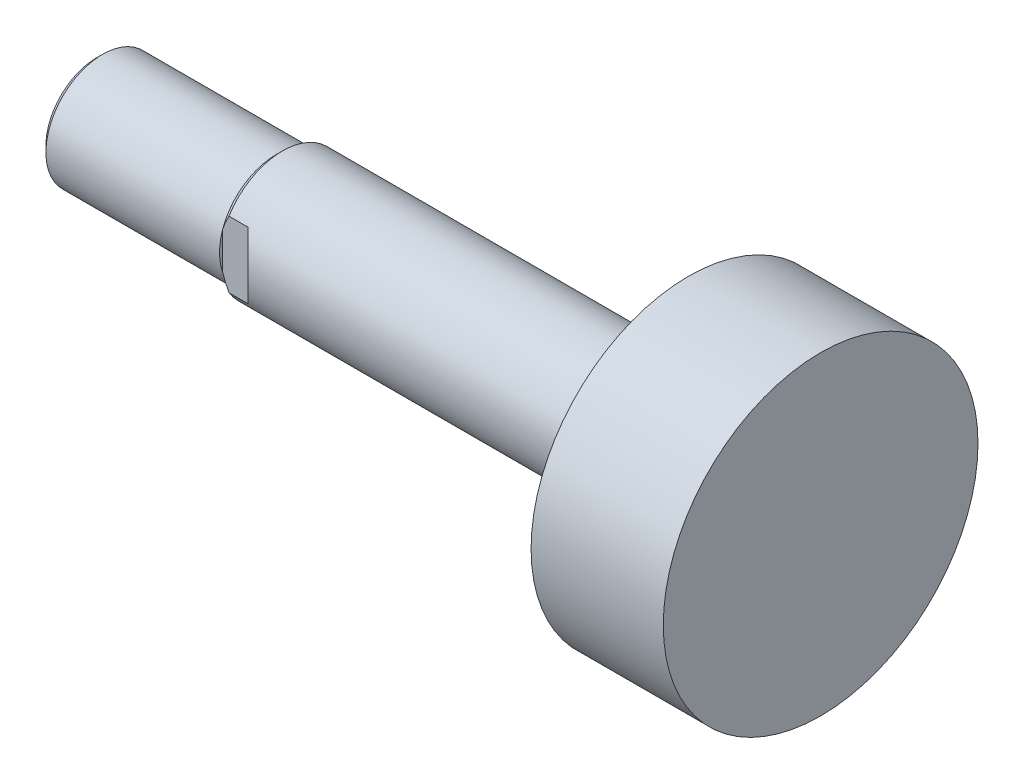
ISO-10303-21;
HEADER;
FILE_DESCRIPTION(('STEP AP214'),'2;1');
FILE_NAME('part.step','',(''),(''),'','','');
FILE_SCHEMA(('AUTOMOTIVE_DESIGN { 1 0 10303 214 1 1 1 1 }'));
ENDSEC;
DATA;
#1=APPLICATION_CONTEXT('core data for automotive mechanical design processes');
#2=APPLICATION_PROTOCOL_DEFINITION('international standard','automotive_design',2000,#1);
#3=PRODUCT_CONTEXT('',#1,'mechanical');
#4=PRODUCT('Part','Part','',(#3));
#5=PRODUCT_RELATED_PRODUCT_CATEGORY('part','',(#4));
#6=PRODUCT_DEFINITION_FORMATION('','',#4);
#7=PRODUCT_DEFINITION_CONTEXT('part definition',#1,'design');
#8=PRODUCT_DEFINITION('design','',#6,#7);
#9=PRODUCT_DEFINITION_SHAPE('','',#8);
#10=(LENGTH_UNIT() NAMED_UNIT(*) SI_UNIT(.MILLI.,.METRE.));
#11=(NAMED_UNIT(*) PLANE_ANGLE_UNIT() SI_UNIT($,.RADIAN.));
#12=(NAMED_UNIT(*) SI_UNIT($,.STERADIAN.) SOLID_ANGLE_UNIT());
#13=UNCERTAINTY_MEASURE_WITH_UNIT(LENGTH_MEASURE(1.E-05),#10,'distance_accuracy_value','');
#14=(GEOMETRIC_REPRESENTATION_CONTEXT(3) GLOBAL_UNCERTAINTY_ASSIGNED_CONTEXT((#13)) GLOBAL_UNIT_ASSIGNED_CONTEXT((#10,
#11,#12)) REPRESENTATION_CONTEXT('',''));
#15=CARTESIAN_POINT('',(0.,0.,0.));
#16=DIRECTION('',(0.,0.,1.));
#17=DIRECTION('',(1.,0.,0.));
#18=AXIS2_PLACEMENT_3D('',#15,#16,#17);
#19=CARTESIAN_POINT('',(-4.,0.,0.));
#20=DIRECTION('',(1.,0.,0.));
#21=DIRECTION('',(0.,0.,1.));
#22=AXIS2_PLACEMENT_3D('',#19,#20,#21);
#23=CONICAL_SURFACE('',#22,10.,0.785398163397448);
#24=CARTESIAN_POINT('',(-4.,0.,0.));
#25=DIRECTION('',(1.,0.,0.));
#26=DIRECTION('',(0.,0.,-1.));
#27=AXIS2_PLACEMENT_3D('',#24,#25,#26);
#28=CIRCLE('',#27,10.);
#29=CARTESIAN_POINT('',(-4.,5.26782687642637,-8.5));
#30=VERTEX_POINT('',#29);
#31=CARTESIAN_POINT('',(-4.,5.26782687642637,8.5));
#32=VERTEX_POINT('',#31);
#33=EDGE_CURVE('E129',#30,#32,#28,.T.);
#34=ORIENTED_EDGE('',*,*,#33,.F.);
#35=CARTESIAN_POINT('',(8.01519063670047,-20.308092445384,-8.5));
#36=CARTESIAN_POINT('',(7.7361785847848,-20.0056182532984,-8.5));
#37=CARTESIAN_POINT('',(7.45765995569865,-19.7026880348963,-8.5));
#38=CARTESIAN_POINT('',(6.90176517488605,-19.0957771073713,-8.5));
#39=CARTESIAN_POINT('',(6.62438903182765,-18.7917963903104,-8.5));
#40=CARTESIAN_POINT('',(6.07087745418935,-18.1825827710552,-8.5));
#41=CARTESIAN_POINT('',(5.79474230969481,-17.8773496050566,-8.5));
#42=CARTESIAN_POINT('',(5.24398019039066,-17.2655281148894,-8.5));
#43=CARTESIAN_POINT('',(4.96935321256268,-16.9589397934352,-8.5));
#44=CARTESIAN_POINT('',(4.14478580015422,-16.0331775775104,-8.5));
#45=CARTESIAN_POINT('',(3.5974766026319,-15.4116476657744,-8.5));
#46=CARTESIAN_POINT('',(2.78380816430985,-14.4730892085653,-8.5));
#47=CARTESIAN_POINT('',(2.5138152184636,-14.159209089997,-8.5));
#48=CARTESIAN_POINT('',(1.97673021972096,-13.52897508431,-8.5));
#49=CARTESIAN_POINT('',(1.70963815361385,-13.2126212084681,-8.5));
#50=CARTESIAN_POINT('',(1.22962921286077,-12.6377055641449,-8.5));
#51=CARTESIAN_POINT('',(1.01610941182202,-12.3796473964932,-8.5));
#52=CARTESIAN_POINT('',(0.591750155601346,-11.8613374878778,-8.5));
#53=CARTESIAN_POINT('',(0.380910678472079,-11.6010857649047,-8.5));
#54=CARTESIAN_POINT('',(-0.0376584099303806,-11.0779783508777,-8.5));
#55=CARTESIAN_POINT('',(-0.245387192834078,-10.8151219961295,-8.5));
#56=CARTESIAN_POINT('',(-0.657066865708467,-10.2864655282631,-8.5));
#57=CARTESIAN_POINT('',(-0.861017783455289,-10.0206654368112,-8.5));
#58=CARTESIAN_POINT('',(-1.26415199097759,-9.48591907241199,-8.5));
#59=CARTESIAN_POINT('',(-1.4633402132824,-9.21697652576224,-8.5));
#60=CARTESIAN_POINT('',(-1.85619918997768,-8.6750645894601,-8.5));
#61=CARTESIAN_POINT('',(-2.04986972807254,-8.40209504258245,-8.5));
#62=CARTESIAN_POINT('',(-2.43032661979991,-7.85155574203699,-8.5));
#63=CARTESIAN_POINT('',(-2.61711587067953,-7.57398799740128,-8.5));
#64=CARTESIAN_POINT('',(-2.98220778874802,-7.01334556695262,-8.5));
#65=CARTESIAN_POINT('',(-3.1605114105711,-6.73027150567248,-8.5));
#66=CARTESIAN_POINT('',(-3.50458625851543,-6.16073556198904,-8.5));
#67=CARTESIAN_POINT('',(-3.6704720212901,-5.87434326842556,-8.5));
#68=CARTESIAN_POINT('',(-3.98901950101887,-5.29419670486178,-8.5));
#69=CARTESIAN_POINT('',(-4.14167975814723,-5.00044162676269,-8.5));
#70=CARTESIAN_POINT('',(-4.42996817465509,-4.40492195427901,-8.5));
#71=CARTESIAN_POINT('',(-4.56561073144721,-4.10316439565824,-8.5));
#72=CARTESIAN_POINT('',(-4.81535306459374,-3.4908140891901,-8.5));
#73=CARTESIAN_POINT('',(-4.92945908792876,-3.18022393353545,-8.5));
#74=CARTESIAN_POINT('',(-5.10882864210821,-2.61868293217367,-8.5));
#75=CARTESIAN_POINT('',(-5.17931789927641,-2.36941081833741,-8.5));
#76=CARTESIAN_POINT('',(-5.30097712319222,-1.86616027833245,-8.5));
#77=CARTESIAN_POINT('',(-5.35214960650299,-1.61218246974123,-8.5));
#78=CARTESIAN_POINT('',(-5.43261746197933,-1.1015319186314,-8.5));
#79=CARTESIAN_POINT('',(-5.46197934937759,-0.844869810696367,-8.5));
#80=CARTESIAN_POINT('',(-5.49747629899316,-0.329928811847654,-8.5));
#81=CARTESIAN_POINT('',(-5.5036124053603,-0.0716499941384873,-8.5));
#82=CARTESIAN_POINT('',(-5.49229216801082,0.444827574385668,-8.5));
#83=CARTESIAN_POINT('',(-5.47479509778217,0.703025418080528,-8.5));
#84=CARTESIAN_POINT('',(-5.41713803657892,1.21685788244489,-8.5));
#85=CARTESIAN_POINT('',(-5.37697616728612,1.47249228888529,-8.5));
#86=CARTESIAN_POINT('',(-5.27590994809915,1.98038492098679,-8.5));
#87=CARTESIAN_POINT('',(-5.21494230073249,2.23263037326977,-8.5));
#88=CARTESIAN_POINT('',(-5.07495959430864,2.73200202992385,-8.5));
#89=CARTESIAN_POINT('',(-4.99594408568338,2.9791281066052,-8.5));
#90=CARTESIAN_POINT('',(-4.80921484945979,3.50573917313348,-8.5));
#91=CARTESIAN_POINT('',(-4.69895230505636,3.78431367662232,-8.5));
#92=CARTESIAN_POINT('',(-4.46189975933577,4.33439896644819,-8.5));
#93=CARTESIAN_POINT('',(-4.335102381747,4.60590653495482,-8.5));
#94=CARTESIAN_POINT('',(-4.0680489135709,5.14275897977233,-8.5));
#95=CARTESIAN_POINT('',(-3.92776978391186,5.40809230836008,-8.5));
#96=CARTESIAN_POINT('',(-3.63659017674462,5.93277996074427,-8.5));
#97=CARTESIAN_POINT('',(-3.48569114282922,6.19213509083541,-8.5));
#98=CARTESIAN_POINT('',(-3.17343042128541,6.70876016534356,-8.5));
#99=CARTESIAN_POINT('',(-3.01196381516393,6.96596639752857,-8.5));
#100=CARTESIAN_POINT('',(-2.68190708992094,7.4757577100788,-8.5));
#101=CARTESIAN_POINT('',(-2.5133167965904,7.72834267721476,-8.5));
#102=CARTESIAN_POINT('',(-2.17048919845416,8.22925435257357,-8.5));
#103=CARTESIAN_POINT('',(-1.99625793113807,8.47758520513955,-8.5));
#104=CARTESIAN_POINT('',(-1.64298541847278,8.97080912154977,-8.5));
#105=CARTESIAN_POINT('',(-1.46394397240567,9.2157020412856,-8.5));
#106=CARTESIAN_POINT('',(-1.10059809810329,9.7041954587909,-8.5));
#107=CARTESIAN_POINT('',(-0.916265740598765,9.94777514580776,-8.5));
#108=CARTESIAN_POINT('',(-0.544180663254515,10.4323108471719,-8.5));
#109=CARTESIAN_POINT('',(-0.356427872872254,10.6732668072437,-8.5));
#110=CARTESIAN_POINT('',(0.211180026363606,11.3927534627755,-8.5));
#111=CARTESIAN_POINT('',(0.595361447438553,11.8678720045883,-8.5));
#112=CARTESIAN_POINT('',(1.37246441028024,12.8114834634273,-8.5));
#113=CARTESIAN_POINT('',(1.7653924464481,13.2799710039858,-8.5));
#114=CARTESIAN_POINT('',(2.55767079172638,14.211489799482,-8.5));
#115=CARTESIAN_POINT('',(2.9570212214443,14.6745209516694,-8.5));
#116=CARTESIAN_POINT('',(3.74033075167738,15.572898310212,-8.5));
#117=CARTESIAN_POINT('',(4.12404469096697,16.008458712548,-8.5));
#118=CARTESIAN_POINT('',(4.89505926014011,16.8764018975631,-8.5));
#119=CARTESIAN_POINT('',(5.28235994315611,17.308784632999,-8.5));
#120=CARTESIAN_POINT('',(6.05923302335684,18.1702364496551,-8.5));
#121=CARTESIAN_POINT('',(6.44880074336689,18.5993097536896,-8.5));
#122=CARTESIAN_POINT('',(7.23032368065001,19.4552486172027,-8.5));
#123=CARTESIAN_POINT('',(7.62227881030234,19.8821142566546,-8.5));
#124=CARTESIAN_POINT('',(8.01519063670047,20.308092445384,-8.5));
#125=B_SPLINE_CURVE_WITH_KNOTS('',3,(#35,#36,#37,#38,#39,#40,#41,#42,#43,#44,#45,#46,#47,#48,
#49,#50,#51,#52,#53,#54,#55,#56,#57,#58,#59,#60,#61,#62,#63,#64,#65,#66,#67,#68,#69,#70,#71,#72,
#73,#74,#75,#76,#77,#78,#79,#80,#81,#82,#83,#84,#85,#86,#87,#88,#89,#90,#91,#92,#93,#94,#95,#96,
#97,#98,#99,#100,#101,#102,#103,#104,#105,#106,#107,#108,#109,#110,#111,#112,#113,#114,#115,
#116,#117,#118,#119,#120,#121,#122,#123,#124),.UNSPECIFIED.,.F.,.F.,(4,2,2,2,2,2,2,2,2,2,2,2,2,
2,2,2,2,2,2,2,2,2,2,2,2,2,2,2,2,2,2,2,2,2,2,2,2,2,2,2,2,2,2,2,4),(0.,1.23452259257757,
2.46905453429761,3.70386142712238,4.93866584775405,7.42305221398594,8.66511507344633,
9.90717227411992,10.9119770974516,11.9167736878189,12.9218332577486,13.9268854352086,
14.930847189359,15.9348482452458,16.9384216368664,17.9418818581811,18.9345065453003,
19.9272406586858,20.9191291471583,21.9107294804817,22.6872174420708,23.4636042089177,
24.2376134165246,25.0115878269729,25.7868977128977,26.5622718611428,27.3400262785907,
28.1178000718358,29.0159336722359,29.9144693140022,30.8145687393038,31.7145460470603,
32.6254677943538,33.5364118310504,34.4464111820271,35.3564485643851,36.2728106057291,
37.1891915674402,39.0220694747481,40.8563569637266,42.6906789394955,44.4320757148612,
46.1734983279044,47.9121094387404,49.650657120432),.UNSPECIFIED.);
#126=CARTESIAN_POINT('',(-5.,2.95803989154981,-8.5));
#127=VERTEX_POINT('',#126);
#128=EDGE_CURVE('E115',#127,#30,#125,.T.);
#129=ORIENTED_EDGE('',*,*,#128,.F.);
#130=CARTESIAN_POINT('',(-5.,0.,0.));
#131=DIRECTION('',(1.,0.,0.));
#132=DIRECTION('',(0.,0.,-1.));
#133=AXIS2_PLACEMENT_3D('',#130,#131,#132);
#134=CIRCLE('',#133,9.);
#135=CARTESIAN_POINT('',(-5.,2.95803989154981,8.5));
#136=VERTEX_POINT('',#135);
#137=EDGE_CURVE('E127',#127,#136,#134,.T.);
#138=ORIENTED_EDGE('',*,*,#137,.T.);
#139=CARTESIAN_POINT('',(8.01519063670047,20.308092445384,8.5));
#140=CARTESIAN_POINT('',(7.7361785847848,20.0056182532984,8.5));
#141=CARTESIAN_POINT('',(7.45765995569865,19.7026880348964,8.5));
#142=CARTESIAN_POINT('',(6.90176517488605,19.0957771073713,8.5));
#143=CARTESIAN_POINT('',(6.62438903182765,18.7917963903104,8.5));
#144=CARTESIAN_POINT('',(6.07087745418935,18.1825827710552,8.5));
#145=CARTESIAN_POINT('',(5.79474230969481,17.8773496050566,8.5));
#146=CARTESIAN_POINT('',(5.24398019039066,17.2655281148894,8.5));
#147=CARTESIAN_POINT('',(4.96935321256268,16.9589397934352,8.5));
#148=CARTESIAN_POINT('',(4.14478580015422,16.0331775775104,8.5));
#149=CARTESIAN_POINT('',(3.5974766026319,15.4116476657744,8.5));
#150=CARTESIAN_POINT('',(2.78380816430986,14.4730892085653,8.5));
#151=CARTESIAN_POINT('',(2.5138152184636,14.159209089997,8.5));
#152=CARTESIAN_POINT('',(1.97673021972096,13.52897508431,8.5));
#153=CARTESIAN_POINT('',(1.70963815361385,13.2126212084681,8.5));
#154=CARTESIAN_POINT('',(1.22962921286077,12.6377055641449,8.5));
#155=CARTESIAN_POINT('',(1.01610941182202,12.3796473964932,8.5));
#156=CARTESIAN_POINT('',(0.591750155601345,11.8613374878778,8.5));
#157=CARTESIAN_POINT('',(0.380910678472077,11.6010857649047,8.5));
#158=CARTESIAN_POINT('',(-0.0376584099303825,11.0779783508777,8.5));
#159=CARTESIAN_POINT('',(-0.245387192834079,10.8151219961295,8.5));
#160=CARTESIAN_POINT('',(-0.657066865708468,10.2864655282631,8.5));
#161=CARTESIAN_POINT('',(-0.86101778345529,10.0206654368112,8.5));
#162=CARTESIAN_POINT('',(-1.26415199097759,9.48591907241199,8.5));
#163=CARTESIAN_POINT('',(-1.46334021328241,9.21697652576224,8.5));
#164=CARTESIAN_POINT('',(-1.85619918997769,8.67506458946009,8.5));
#165=CARTESIAN_POINT('',(-2.04986972807254,8.40209504258244,8.5));
#166=CARTESIAN_POINT('',(-2.43032661979991,7.85155574203699,8.5));
#167=CARTESIAN_POINT('',(-2.61711587067953,7.57398799740128,8.5));
#168=CARTESIAN_POINT('',(-2.98220778874802,7.01334556695261,8.5));
#169=CARTESIAN_POINT('',(-3.1605114105711,6.73027150567247,8.5));
#170=CARTESIAN_POINT('',(-3.50458625851543,6.16073556198903,8.5));
#171=CARTESIAN_POINT('',(-3.6704720212901,5.87434326842555,8.5));
#172=CARTESIAN_POINT('',(-3.98901950101887,5.29419670486178,8.5));
#173=CARTESIAN_POINT('',(-4.14167975814724,5.00044162676269,8.5));
#174=CARTESIAN_POINT('',(-4.42996817465509,4.404921954279,8.5));
#175=CARTESIAN_POINT('',(-4.56561073144721,4.10316439565823,8.5));
#176=CARTESIAN_POINT('',(-4.81535306459375,3.49081408919009,8.5));
#177=CARTESIAN_POINT('',(-4.92945908792876,3.18022393353545,8.5));
#178=CARTESIAN_POINT('',(-5.10882864210821,2.61868293217366,8.5));
#179=CARTESIAN_POINT('',(-5.17931789927641,2.3694108183374,8.5));
#180=CARTESIAN_POINT('',(-5.30097712319222,1.86616027833244,8.5));
#181=CARTESIAN_POINT('',(-5.35214960650299,1.61218246974123,8.5));
#182=CARTESIAN_POINT('',(-5.43261746197934,1.10153191863139,8.5));
#183=CARTESIAN_POINT('',(-5.46197934937759,0.844869810696362,8.5));
#184=CARTESIAN_POINT('',(-5.49747629899316,0.329928811847649,8.5));
#185=CARTESIAN_POINT('',(-5.5036124053603,0.0716499941384825,8.5));
#186=CARTESIAN_POINT('',(-5.49229216801082,-0.444827574385673,8.5));
#187=CARTESIAN_POINT('',(-5.47479509778217,-0.703025418080532,8.5));
#188=CARTESIAN_POINT('',(-5.41713803657892,-1.21685788244489,8.5));
#189=CARTESIAN_POINT('',(-5.37697616728612,-1.47249228888529,8.5));
#190=CARTESIAN_POINT('',(-5.27590994809915,-1.98038492098679,8.5));
#191=CARTESIAN_POINT('',(-5.21494230073249,-2.23263037326976,8.5));
#192=CARTESIAN_POINT('',(-5.07495959430864,-2.73200202992384,8.5));
#193=CARTESIAN_POINT('',(-4.99594408568338,-2.9791281066052,8.5));
#194=CARTESIAN_POINT('',(-4.80921484945979,-3.50573917313349,8.5));
#195=CARTESIAN_POINT('',(-4.69895230505636,-3.78431367662233,8.5));
#196=CARTESIAN_POINT('',(-4.46189975933577,-4.33439896644819,8.5));
#197=CARTESIAN_POINT('',(-4.335102381747,-4.60590653495482,8.5));
#198=CARTESIAN_POINT('',(-4.0680489135709,-5.14275897977233,8.5));
#199=CARTESIAN_POINT('',(-3.92776978391186,-5.40809230836008,8.5));
#200=CARTESIAN_POINT('',(-3.63659017674462,-5.93277996074427,8.5));
#201=CARTESIAN_POINT('',(-3.48569114282922,-6.19213509083541,8.5));
#202=CARTESIAN_POINT('',(-3.17343042128541,-6.70876016534357,8.5));
#203=CARTESIAN_POINT('',(-3.01196381516393,-6.96596639752857,8.5));
#204=CARTESIAN_POINT('',(-2.68190708992094,-7.4757577100788,8.5));
#205=CARTESIAN_POINT('',(-2.5133167965904,-7.72834267721476,8.5));
#206=CARTESIAN_POINT('',(-2.17048919845415,-8.22925435257358,8.5));
#207=CARTESIAN_POINT('',(-1.99625793113806,-8.47758520513955,8.5));
#208=CARTESIAN_POINT('',(-1.64298541847278,-8.97080912154977,8.5));
#209=CARTESIAN_POINT('',(-1.46394397240567,-9.21570204128561,8.5));
#210=CARTESIAN_POINT('',(-1.10059809810329,-9.7041954587909,8.5));
#211=CARTESIAN_POINT('',(-0.916265740598766,-9.94777514580776,8.5));
#212=CARTESIAN_POINT('',(-0.544180663254515,-10.4323108471719,8.5));
#213=CARTESIAN_POINT('',(-0.356427872872254,-10.6732668072437,8.5));
#214=CARTESIAN_POINT('',(0.211180026363605,-11.3927534627755,8.5));
#215=CARTESIAN_POINT('',(0.595361447438551,-11.8678720045883,8.5));
#216=CARTESIAN_POINT('',(1.37246441028024,-12.8114834634273,8.5));
#217=CARTESIAN_POINT('',(1.7653924464481,-13.2799710039858,8.5));
#218=CARTESIAN_POINT('',(2.55767079172638,-14.211489799482,8.5));
#219=CARTESIAN_POINT('',(2.9570212214443,-14.6745209516694,8.5));
#220=CARTESIAN_POINT('',(3.74033075167738,-15.572898310212,8.5));
#221=CARTESIAN_POINT('',(4.12404469096696,-16.008458712548,8.5));
#222=CARTESIAN_POINT('',(4.8950592601401,-16.8764018975631,8.5));
#223=CARTESIAN_POINT('',(5.2823599431561,-17.308784632999,8.5));
#224=CARTESIAN_POINT('',(6.05923302335683,-18.1702364496551,8.5));
#225=CARTESIAN_POINT('',(6.44880074336688,-18.5993097536896,8.5));
#226=CARTESIAN_POINT('',(7.23032368065,-19.4552486172027,8.5));
#227=CARTESIAN_POINT('',(7.62227881030234,-19.8821142566546,8.5));
#228=CARTESIAN_POINT('',(8.01519063670047,-20.308092445384,8.5));
#229=B_SPLINE_CURVE_WITH_KNOTS('',3,(#139,#140,#141,#142,#143,#144,#145,#146,#147,#148,#149,
#150,#151,#152,#153,#154,#155,#156,#157,#158,#159,#160,#161,#162,#163,#164,#165,#166,#167,#168,
#169,#170,#171,#172,#173,#174,#175,#176,#177,#178,#179,#180,#181,#182,#183,#184,#185,#186,#187,
#188,#189,#190,#191,#192,#193,#194,#195,#196,#197,#198,#199,#200,#201,#202,#203,#204,#205,#206,
#207,#208,#209,#210,#211,#212,#213,#214,#215,#216,#217,#218,#219,#220,#221,#222,#223,#224,#225,
#226,#227,#228),.UNSPECIFIED.,.F.,.F.,(4,2,2,2,2,2,2,2,2,2,2,2,2,2,2,2,2,2,2,2,2,2,2,2,2,2,2,2,
2,2,2,2,2,2,2,2,2,2,2,2,2,2,2,2,4),(0.,1.23452259257757,2.46905453429761,3.70386142712238,
4.93866584775406,7.42305221398594,8.66511507344633,9.90717227411993,10.9119770974516,
11.9167736878189,12.9218332577486,13.9268854352086,14.930847189359,15.9348482452458,
16.9384216368664,17.9418818581811,18.9345065453003,19.9272406586858,20.9191291471583,
21.9107294804817,22.6872174420708,23.4636042089177,24.2376134165246,25.0115878269729,
25.7868977128977,26.5622718611428,27.3400262785907,28.1178000718358,29.0159336722359,
29.9144693140022,30.8145687393038,31.7145460470604,32.6254677943538,33.5364118310505,
34.4464111820271,35.3564485643851,36.2728106057291,37.1891915674402,39.0220694747481,
40.8563569637266,42.6906789394955,44.4320757148611,46.1734983279044,47.9121094387404,
49.650657120432),.UNSPECIFIED.);
#230=EDGE_CURVE('E140',#32,#136,#229,.T.);
#231=ORIENTED_EDGE('',*,*,#230,.F.);
#232=EDGE_LOOP('',(#34,#129,#138,#231));
#233=FACE_BOUND('',#232,.T.);
#234=ADVANCED_FACE('F42',(#233),#23,.T.);
#235=CARTESIAN_POINT('',(81.5,0.,0.));
#236=DIRECTION('',(-1.,0.,0.));
#237=DIRECTION('',(0.,0.,-1.));
#238=AXIS2_PLACEMENT_3D('',#235,#236,#237);
#239=CYLINDRICAL_SURFACE('',#238,10.);
#240=CARTESIAN_POINT('',(60.5,0.,0.));
#241=DIRECTION('',(1.,0.,0.));
#242=DIRECTION('',(0.,0.,-1.));
#243=AXIS2_PLACEMENT_3D('',#240,#241,#242);
#244=CIRCLE('',#243,10.);
#245=CARTESIAN_POINT('',(60.5,0.,-10.));
#246=VERTEX_POINT('',#245);
#247=EDGE_CURVE('E211',#246,#246,#244,.T.);
#248=ORIENTED_EDGE('',*,*,#247,.F.);
#249=EDGE_LOOP('',(#248));
#250=FACE_BOUND('',#249,.T.);
#251=CARTESIAN_POINT('',(-9.49999999999999,0.,0.));
#252=DIRECTION('',(-0.707106781186547,0.,0.707106781186547));
#253=DIRECTION('',(-0.707106781186548,0.,-0.707106781186548));
#254=AXIS2_PLACEMENT_3D('',#251,#252,#253);
#255=ELLIPSE('',#254,14.142135623731,10.);
#256=CARTESIAN_POINT('',(-1.,-5.26782687642637,8.5));
#257=VERTEX_POINT('',#256);
#258=CARTESIAN_POINT('',(-1.,5.26782687642637,8.5));
#259=VERTEX_POINT('',#258);
#260=EDGE_CURVE('E11',#257,#259,#255,.T.);
#261=ORIENTED_EDGE('',*,*,#260,.F.);
#262=DIRECTION('',(-1.,0.,0.));
#263=VECTOR('',#262,1.);
#264=CARTESIAN_POINT('',(81.5,-5.26782687642637,8.5));
#265=LINE('',#264,#263);
#266=CARTESIAN_POINT('',(-4.,-5.26782687642637,8.5));
#267=VERTEX_POINT('',#266);
#268=EDGE_CURVE('E198',#267,#257,#265,.F.);
#269=ORIENTED_EDGE('',*,*,#268,.F.);
#270=CARTESIAN_POINT('',(-4.,-5.26782687642637,-8.5));
#271=VERTEX_POINT('',#270);
#272=EDGE_CURVE('E130',#267,#271,#28,.T.);
#273=ORIENTED_EDGE('',*,*,#272,.T.);
#274=DIRECTION('',(-1.,0.,0.));
#275=VECTOR('',#274,1.);
#276=CARTESIAN_POINT('',(81.5,-5.26782687642637,-8.5));
#277=LINE('',#276,#275);
#278=CARTESIAN_POINT('',(-1.,-5.26782687642638,-8.5));
#279=VERTEX_POINT('',#278);
#280=EDGE_CURVE('E110',#279,#271,#277,.T.);
#281=ORIENTED_EDGE('',*,*,#280,.F.);
#282=CARTESIAN_POINT('',(-9.49999999999999,0.,0.));
#283=DIRECTION('',(-0.707106781186547,0.,-0.707106781186547));
#284=DIRECTION('',(-0.707106781186548,0.,0.707106781186548));
#285=AXIS2_PLACEMENT_3D('',#282,#283,#284);
#286=ELLIPSE('',#285,14.142135623731,10.);
#287=CARTESIAN_POINT('',(-1.,5.26782687642637,-8.5));
#288=VERTEX_POINT('',#287);
#289=EDGE_CURVE('E50',#288,#279,#286,.T.);
#290=ORIENTED_EDGE('',*,*,#289,.F.);
#291=DIRECTION('',(-1.,0.,0.));
#292=VECTOR('',#291,1.);
#293=CARTESIAN_POINT('',(81.5,5.26782687642637,-8.5));
#294=LINE('',#293,#292);
#295=EDGE_CURVE('E57',#30,#288,#294,.F.);
#296=ORIENTED_EDGE('',*,*,#295,.F.);
#297=ORIENTED_EDGE('',*,*,#33,.T.);
#298=DIRECTION('',(-1.,0.,0.));
#299=VECTOR('',#298,1.);
#300=CARTESIAN_POINT('',(81.5,5.26782687642637,8.5));
#301=LINE('',#300,#299);
#302=EDGE_CURVE('E143',#259,#32,#301,.T.);
#303=ORIENTED_EDGE('',*,*,#302,.F.);
#304=EDGE_LOOP('',(#261,#269,#273,#281,#290,#296,#297,#303));
#305=FACE_BOUND('',#304,.T.);
#306=ADVANCED_FACE('F44',(#250,#305),#239,.T.);
#307=CARTESIAN_POINT('',(60.5,10.,0.));
#308=DIRECTION('',(1.,0.,0.));
#309=DIRECTION('',(0.,0.,1.));
#310=AXIS2_PLACEMENT_3D('',#307,#308,#309);
#311=PLANE('',#310);
#312=ORIENTED_EDGE('',*,*,#247,.T.);
#313=EDGE_LOOP('',(#312));
#314=FACE_BOUND('',#313,.T.);
#315=CARTESIAN_POINT('',(60.5,0.,0.));
#316=DIRECTION('',(1.,0.,0.));
#317=DIRECTION('',(0.,0.,-1.));
#318=AXIS2_PLACEMENT_3D('',#315,#316,#317);
#319=CIRCLE('',#318,25.);
#320=CARTESIAN_POINT('',(60.5,0.,-25.));
#321=VERTEX_POINT('',#320);
#322=EDGE_CURVE('E212',#321,#321,#319,.T.);
#323=ORIENTED_EDGE('',*,*,#322,.F.);
#324=EDGE_LOOP('',(#323));
#325=FACE_BOUND('',#324,.T.);
#326=ADVANCED_FACE('F183',(#314,#325),#311,.F.);
#327=CARTESIAN_POINT('',(81.5,0.,0.));
#328=DIRECTION('',(-1.,0.,0.));
#329=DIRECTION('',(0.,0.,-1.));
#330=AXIS2_PLACEMENT_3D('',#327,#328,#329);
#331=CYLINDRICAL_SURFACE('',#330,25.);
#332=ORIENTED_EDGE('',*,*,#322,.T.);
#333=EDGE_LOOP('',(#332));
#334=FACE_BOUND('',#333,.T.);
#335=CARTESIAN_POINT('',(81.5,0.,0.));
#336=DIRECTION('',(1.,0.,0.));
#337=DIRECTION('',(0.,0.,-1.));
#338=AXIS2_PLACEMENT_3D('',#335,#336,#337);
#339=CIRCLE('',#338,25.);
#340=CARTESIAN_POINT('',(81.5,0.,-25.));
#341=VERTEX_POINT('',#340);
#342=EDGE_CURVE('E215',#341,#341,#339,.T.);
#343=ORIENTED_EDGE('',*,*,#342,.F.);
#344=EDGE_LOOP('',(#343));
#345=FACE_BOUND('',#344,.T.);
#346=ADVANCED_FACE('F180',(#334,#345),#331,.T.);
#347=CARTESIAN_POINT('',(81.5,25.,0.));
#348=DIRECTION('',(-1.,0.,0.));
#349=DIRECTION('',(0.,0.,-1.));
#350=AXIS2_PLACEMENT_3D('',#347,#348,#349);
#351=PLANE('',#350);
#352=ORIENTED_EDGE('',*,*,#342,.T.);
#353=EDGE_LOOP('',(#352));
#354=FACE_BOUND('',#353,.T.);
#355=ADVANCED_FACE('F176',(#354),#351,.F.);
#356=CARTESIAN_POINT('',(-33.5,0.,0.));
#357=DIRECTION('',(1.,0.,0.));
#358=DIRECTION('',(0.,0.,1.));
#359=AXIS2_PLACEMENT_3D('',#356,#357,#358);
#360=PLANE('',#359);
#361=CARTESIAN_POINT('',(-33.5,0.,0.));
#362=DIRECTION('',(1.,0.,0.));
#363=DIRECTION('',(0.,0.,-1.));
#364=AXIS2_PLACEMENT_3D('',#361,#362,#363);
#365=CIRCLE('',#364,8.08);
#366=CARTESIAN_POINT('',(-33.5,0.,-8.08));
#367=VERTEX_POINT('',#366);
#368=EDGE_CURVE('E137',#367,#367,#365,.T.);
#369=ORIENTED_EDGE('',*,*,#368,.F.);
#370=EDGE_LOOP('',(#369));
#371=FACE_BOUND('',#370,.T.);
#372=ADVANCED_FACE('F172',(#371),#360,.F.);
#373=CARTESIAN_POINT('',(-32.58,0.,0.));
#374=DIRECTION('',(1.,0.,0.));
#375=DIRECTION('',(0.,0.,1.));
#376=AXIS2_PLACEMENT_3D('',#373,#374,#375);
#377=CONICAL_SURFACE('',#376,9.,0.785398163397446);
#378=ORIENTED_EDGE('',*,*,#368,.T.);
#379=EDGE_LOOP('',(#378));
#380=FACE_BOUND('',#379,.T.);
#381=CARTESIAN_POINT('',(-32.58,0.,0.));
#382=DIRECTION('',(1.,0.,0.));
#383=DIRECTION('',(0.,0.,-1.));
#384=AXIS2_PLACEMENT_3D('',#381,#382,#383);
#385=CIRCLE('',#384,9.);
#386=CARTESIAN_POINT('',(-32.58,0.,-9.));
#387=VERTEX_POINT('',#386);
#388=EDGE_CURVE('E133',#387,#387,#385,.T.);
#389=ORIENTED_EDGE('',*,*,#388,.F.);
#390=EDGE_LOOP('',(#389));
#391=FACE_BOUND('',#390,.T.);
#392=ADVANCED_FACE('F168',(#380,#391),#377,.T.);
#393=CARTESIAN_POINT('',(0.,0.,0.));
#394=DIRECTION('',(-1.,0.,0.));
#395=DIRECTION('',(0.,0.,-1.));
#396=AXIS2_PLACEMENT_3D('',#393,#394,#395);
#397=CYLINDRICAL_SURFACE('',#396,9.);
#398=ORIENTED_EDGE('',*,*,#388,.T.);
#399=EDGE_LOOP('',(#398));
#400=FACE_BOUND('',#399,.T.);
#401=ORIENTED_EDGE('',*,*,#137,.F.);
#402=CARTESIAN_POINT('',(-5.,-2.95803989154981,-8.5));
#403=VERTEX_POINT('',#402);
#404=EDGE_CURVE('E100',#403,#127,#134,.T.);
#405=ORIENTED_EDGE('',*,*,#404,.F.);
#406=CARTESIAN_POINT('',(-5.,-2.95803989154981,8.5));
#407=VERTEX_POINT('',#406);
#408=EDGE_CURVE('E118',#407,#403,#134,.T.);
#409=ORIENTED_EDGE('',*,*,#408,.F.);
#410=EDGE_CURVE('E123',#136,#407,#134,.T.);
#411=ORIENTED_EDGE('',*,*,#410,.F.);
#412=EDGE_LOOP('',(#401,#405,#409,#411));
#413=FACE_BOUND('',#412,.T.);
#414=ADVANCED_FACE('F125',(#400,#413),#397,.T.);
#415=ORIENTED_EDGE('',*,*,#408,.T.);
#416=EDGE_CURVE('E106',#271,#403,#125,.T.);
#417=ORIENTED_EDGE('',*,*,#416,.F.);
#418=ORIENTED_EDGE('',*,*,#272,.F.);
#419=EDGE_CURVE('E114',#407,#267,#229,.T.);
#420=ORIENTED_EDGE('',*,*,#419,.F.);
#421=EDGE_LOOP('',(#415,#417,#418,#420));
#422=FACE_BOUND('',#421,.T.);
#423=ADVANCED_FACE('F119',(#422),#23,.T.);
#424=CARTESIAN_POINT('',(-1.,-17.,-8.5));
#425=DIRECTION('',(0.,0.,1.));
#426=DIRECTION('',(-1.,0.,0.));
#427=AXIS2_PLACEMENT_3D('',#424,#425,#426);
#428=PLANE('',#427);
#429=DIRECTION('',(0.,1.,0.));
#430=VECTOR('',#429,1.);
#431=CARTESIAN_POINT('',(-1.,-17.,-8.5));
#432=LINE('',#431,#430);
#433=EDGE_CURVE('E103',#279,#288,#432,.T.);
#434=ORIENTED_EDGE('',*,*,#433,.F.);
#435=ORIENTED_EDGE('',*,*,#280,.T.);
#436=ORIENTED_EDGE('',*,*,#416,.T.);
#437=DIRECTION('',(0.,1.,0.));
#438=VECTOR('',#437,1.);
#439=CARTESIAN_POINT('',(-5.,-17.,-8.5));
#440=LINE('',#439,#438);
#441=EDGE_CURVE('E96',#403,#127,#440,.T.);
#442=ORIENTED_EDGE('',*,*,#441,.T.);
#443=ORIENTED_EDGE('',*,*,#128,.T.);
#444=ORIENTED_EDGE('',*,*,#295,.T.);
#445=EDGE_LOOP('',(#434,#435,#436,#442,#443,#444));
#446=FACE_BOUND('',#445,.T.);
#447=ADVANCED_FACE('F108',(#446),#428,.F.);
#448=CARTESIAN_POINT('',(-5.,-17.,-8.5));
#449=DIRECTION('',(-1.,0.,0.));
#450=DIRECTION('',(0.,0.,-1.));
#451=AXIS2_PLACEMENT_3D('',#448,#449,#450);
#452=PLANE('',#451);
#453=ORIENTED_EDGE('',*,*,#441,.F.);
#454=ORIENTED_EDGE('',*,*,#404,.T.);
#455=EDGE_LOOP('',(#453,#454));
#456=FACE_BOUND('',#455,.T.);
#457=ADVANCED_FACE('F98',(#456),#452,.F.);
#458=CARTESIAN_POINT('',(19.,-17.,-28.5));
#459=DIRECTION('',(0.707106781186547,0.,0.707106781186547));
#460=DIRECTION('',(-0.707106781186548,0.,0.707106781186548));
#461=AXIS2_PLACEMENT_3D('',#458,#459,#460);
#462=PLANE('',#461);
#463=ORIENTED_EDGE('',*,*,#433,.T.);
#464=ORIENTED_EDGE('',*,*,#289,.T.);
#465=EDGE_LOOP('',(#463,#464));
#466=FACE_BOUND('',#465,.T.);
#467=ADVANCED_FACE('F164',(#466),#462,.F.);
#468=CARTESIAN_POINT('',(-1.,-17.,8.5));
#469=DIRECTION('',(0.707106781186547,0.,-0.707106781186547));
#470=DIRECTION('',(0.707106781186548,0.,0.707106781186548));
#471=AXIS2_PLACEMENT_3D('',#468,#469,#470);
#472=PLANE('',#471);
#473=DIRECTION('',(0.,1.,0.));
#474=VECTOR('',#473,1.);
#475=CARTESIAN_POINT('',(-1.,-17.,8.5));
#476=LINE('',#475,#474);
#477=EDGE_CURVE('E202',#257,#259,#476,.T.);
#478=ORIENTED_EDGE('',*,*,#477,.F.);
#479=ORIENTED_EDGE('',*,*,#260,.T.);
#480=EDGE_LOOP('',(#478,#479));
#481=FACE_BOUND('',#480,.T.);
#482=ADVANCED_FACE('F201',(#481),#472,.F.);
#483=CARTESIAN_POINT('',(-5.,-17.,8.5));
#484=DIRECTION('',(0.,0.,-1.));
#485=DIRECTION('',(1.,0.,0.));
#486=AXIS2_PLACEMENT_3D('',#483,#484,#485);
#487=PLANE('',#486);
#488=ORIENTED_EDGE('',*,*,#477,.T.);
#489=ORIENTED_EDGE('',*,*,#302,.T.);
#490=ORIENTED_EDGE('',*,*,#230,.T.);
#491=DIRECTION('',(0.,1.,0.));
#492=VECTOR('',#491,1.);
#493=CARTESIAN_POINT('',(-5.,-17.,8.5));
#494=LINE('',#493,#492);
#495=EDGE_CURVE('E65',#407,#136,#494,.T.);
#496=ORIENTED_EDGE('',*,*,#495,.F.);
#497=ORIENTED_EDGE('',*,*,#419,.T.);
#498=ORIENTED_EDGE('',*,*,#268,.T.);
#499=EDGE_LOOP('',(#488,#489,#490,#496,#497,#498));
#500=FACE_BOUND('',#499,.T.);
#501=ADVANCED_FACE('F141',(#500),#487,.F.);
#502=CARTESIAN_POINT('',(-5.,-17.,18.5));
#503=DIRECTION('',(-1.,0.,0.));
#504=DIRECTION('',(0.,0.,-1.));
#505=AXIS2_PLACEMENT_3D('',#502,#503,#504);
#506=PLANE('',#505);
#507=ORIENTED_EDGE('',*,*,#495,.T.);
#508=ORIENTED_EDGE('',*,*,#410,.T.);
#509=EDGE_LOOP('',(#507,#508));
#510=FACE_BOUND('',#509,.T.);
#511=ADVANCED_FACE('F139',(#510),#506,.F.);
#512=CLOSED_SHELL('',(#234,#306,#326,#346,#355,#372,#392,#414,#423,#447,#457,#467,#482,#501,#511));
#513=MANIFOLD_SOLID_BREP('B2',#512);
#514=ADVANCED_BREP_SHAPE_REPRESENTATION('',(#18,#513),#14);
#515=SHAPE_DEFINITION_REPRESENTATION(#9,#514);
ENDSEC;
END-ISO-10303-21;
